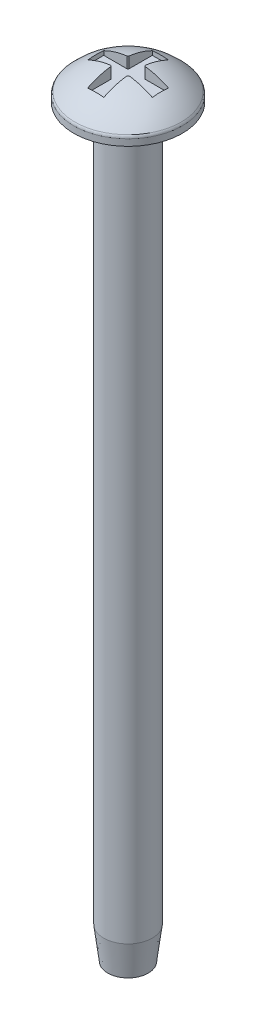
ISO-10303-21;
HEADER;
FILE_DESCRIPTION(('STEP AP214'),'2;1');
FILE_NAME('part.step','',(''),(''),'','','');
FILE_SCHEMA(('AUTOMOTIVE_DESIGN { 1 0 10303 214 1 1 1 1 }'));
ENDSEC;
DATA;
#1=APPLICATION_CONTEXT('core data for automotive mechanical design processes');
#2=APPLICATION_PROTOCOL_DEFINITION('international standard','automotive_design',2000,#1);
#3=PRODUCT_CONTEXT('',#1,'mechanical');
#4=PRODUCT('Part','Part','',(#3));
#5=PRODUCT_RELATED_PRODUCT_CATEGORY('part','',(#4));
#6=PRODUCT_DEFINITION_FORMATION('','',#4);
#7=PRODUCT_DEFINITION_CONTEXT('part definition',#1,'design');
#8=PRODUCT_DEFINITION('design','',#6,#7);
#9=PRODUCT_DEFINITION_SHAPE('','',#8);
#10=(LENGTH_UNIT() NAMED_UNIT(*) SI_UNIT(.MILLI.,.METRE.));
#11=(NAMED_UNIT(*) PLANE_ANGLE_UNIT() SI_UNIT($,.RADIAN.));
#12=(NAMED_UNIT(*) SI_UNIT($,.STERADIAN.) SOLID_ANGLE_UNIT());
#13=UNCERTAINTY_MEASURE_WITH_UNIT(LENGTH_MEASURE(1.E-05),#10,'distance_accuracy_value','');
#14=(GEOMETRIC_REPRESENTATION_CONTEXT(3) GLOBAL_UNCERTAINTY_ASSIGNED_CONTEXT((#13)) GLOBAL_UNIT_ASSIGNED_CONTEXT((#10,
#11,#12)) REPRESENTATION_CONTEXT('',''));
#15=CARTESIAN_POINT('',(0.,0.,0.));
#16=DIRECTION('',(0.,0.,1.));
#17=DIRECTION('',(1.,0.,0.));
#18=AXIS2_PLACEMENT_3D('',#15,#16,#17);
#19=CARTESIAN_POINT('',(0.,0.,0.));
#20=DIRECTION('',(0.,-1.,0.));
#21=DIRECTION('',(1.,0.,0.));
#22=AXIS2_PLACEMENT_3D('',#19,#20,#21);
#23=SPHERICAL_SURFACE('',#22,4.5);
#24=CARTESIAN_POINT('',(0.,3.07369941468059,0.));
#25=DIRECTION('',(0.,-1.,0.));
#26=DIRECTION('',(0.,0.,-1.));
#27=AXIS2_PLACEMENT_3D('',#24,#25,#26);
#28=CIRCLE('',#27,3.28669619955849);
#29=CARTESIAN_POINT('',(0.,3.07369941468059,-3.28669619955849));
#30=VERTEX_POINT('',#29);
#31=EDGE_CURVE('E173',#30,#30,#28,.F.);
#32=ORIENTED_EDGE('',*,*,#31,.T.);
#33=EDGE_LOOP('',(#32));
#34=FACE_BOUND('',#33,.T.);
#35=CARTESIAN_POINT('',(-0.5,0.,0.));
#36=DIRECTION('',(1.,0.,0.));
#37=DIRECTION('',(0.,0.,-1.));
#38=AXIS2_PLACEMENT_3D('',#35,#36,#37);
#39=CIRCLE('',#38,4.47213595499958);
#40=CARTESIAN_POINT('',(-0.5,4.43705983732471,-0.559016994374947));
#41=VERTEX_POINT('',#40);
#42=CARTESIAN_POINT('',(-0.5,4.,-2.));
#43=VERTEX_POINT('',#42);
#44=EDGE_CURVE('E182',#41,#43,#39,.F.);
#45=ORIENTED_EDGE('',*,*,#44,.T.);
#46=CARTESIAN_POINT('',(0.,0.,-2.));
#47=DIRECTION('',(0.,0.,1.));
#48=DIRECTION('',(1.,0.,0.));
#49=AXIS2_PLACEMENT_3D('',#46,#47,#48);
#50=CIRCLE('',#49,4.03112887414927);
#51=CARTESIAN_POINT('',(0.5,4.,-2.));
#52=VERTEX_POINT('',#51);
#53=EDGE_CURVE('E11',#43,#52,#50,.F.);
#54=ORIENTED_EDGE('',*,*,#53,.T.);
#55=CARTESIAN_POINT('',(0.5,0.,0.));
#56=DIRECTION('',(-1.,0.,0.));
#57=DIRECTION('',(0.,0.,1.));
#58=AXIS2_PLACEMENT_3D('',#55,#56,#57);
#59=CIRCLE('',#58,4.47213595499958);
#60=CARTESIAN_POINT('',(0.5,4.43705983732471,-0.559016994374947));
#61=VERTEX_POINT('',#60);
#62=EDGE_CURVE('E38',#52,#61,#59,.F.);
#63=ORIENTED_EDGE('',*,*,#62,.T.);
#64=CARTESIAN_POINT('',(0.,4.43705983732471,0.));
#65=DIRECTION('',(0.,-1.,0.));
#66=DIRECTION('',(0.,0.,-1.));
#67=AXIS2_PLACEMENT_3D('',#64,#65,#66);
#68=CIRCLE('',#67,0.75);
#69=CARTESIAN_POINT('',(0.559016994374942,4.43705983732471,-0.500000000000006));
#70=VERTEX_POINT('',#69);
#71=EDGE_CURVE('E221',#61,#70,#68,.T.);
#72=ORIENTED_EDGE('',*,*,#71,.T.);
#73=CARTESIAN_POINT('',(0.,0.,-0.5));
#74=DIRECTION('',(0.,0.,1.));
#75=DIRECTION('',(1.,0.,0.));
#76=AXIS2_PLACEMENT_3D('',#73,#74,#75);
#77=CIRCLE('',#76,4.47213595499958);
#78=CARTESIAN_POINT('',(1.99999999999999,4.,-0.500000000000021));
#79=VERTEX_POINT('',#78);
#80=EDGE_CURVE('E218',#70,#79,#77,.F.);
#81=ORIENTED_EDGE('',*,*,#80,.T.);
#82=CARTESIAN_POINT('',(2.,0.,0.));
#83=DIRECTION('',(-1.,0.,0.));
#84=DIRECTION('',(0.,0.,1.));
#85=AXIS2_PLACEMENT_3D('',#82,#83,#84);
#86=CIRCLE('',#85,4.03112887414927);
#87=CARTESIAN_POINT('',(2.00000000000001,4.,0.499999999999979));
#88=VERTEX_POINT('',#87);
#89=EDGE_CURVE('E215',#79,#88,#86,.F.);
#90=ORIENTED_EDGE('',*,*,#89,.T.);
#91=CARTESIAN_POINT('',(0.,0.,0.5));
#92=DIRECTION('',(0.,0.,-1.));
#93=DIRECTION('',(-1.,0.,0.));
#94=AXIS2_PLACEMENT_3D('',#91,#92,#93);
#95=CIRCLE('',#94,4.47213595499958);
#96=CARTESIAN_POINT('',(0.559016994374952,4.43705983732471,0.499999999999994));
#97=VERTEX_POINT('',#96);
#98=EDGE_CURVE('E212',#88,#97,#95,.F.);
#99=ORIENTED_EDGE('',*,*,#98,.T.);
#100=CARTESIAN_POINT('',(0.,4.43705983732471,0.));
#101=DIRECTION('',(0.,-1.,0.));
#102=DIRECTION('',(0.,0.,-1.));
#103=AXIS2_PLACEMENT_3D('',#100,#101,#102);
#104=CIRCLE('',#103,0.75);
#105=CARTESIAN_POINT('',(0.500000000000004,4.43705983732471,0.559016994374944));
#106=VERTEX_POINT('',#105);
#107=EDGE_CURVE('E209',#97,#106,#104,.T.);
#108=ORIENTED_EDGE('',*,*,#107,.T.);
#109=CARTESIAN_POINT('',(0.5,0.,0.));
#110=DIRECTION('',(-1.,0.,0.));
#111=DIRECTION('',(0.,0.,1.));
#112=AXIS2_PLACEMENT_3D('',#109,#110,#111);
#113=CIRCLE('',#112,4.47213595499958);
#114=CARTESIAN_POINT('',(0.500000000000014,4.,2.));
#115=VERTEX_POINT('',#114);
#116=EDGE_CURVE('E206',#106,#115,#113,.F.);
#117=ORIENTED_EDGE('',*,*,#116,.T.);
#118=CARTESIAN_POINT('',(0.,0.,2.));
#119=DIRECTION('',(0.,0.,-1.));
#120=DIRECTION('',(-1.,0.,0.));
#121=AXIS2_PLACEMENT_3D('',#118,#119,#120);
#122=CIRCLE('',#121,4.03112887414927);
#123=CARTESIAN_POINT('',(-0.499999999999986,4.,2.));
#124=VERTEX_POINT('',#123);
#125=EDGE_CURVE('E203',#115,#124,#122,.F.);
#126=ORIENTED_EDGE('',*,*,#125,.T.);
#127=CARTESIAN_POINT('',(-0.5,0.,0.));
#128=DIRECTION('',(1.,0.,0.));
#129=DIRECTION('',(0.,0.,-1.));
#130=AXIS2_PLACEMENT_3D('',#127,#128,#129);
#131=CIRCLE('',#130,4.47213595499958);
#132=CARTESIAN_POINT('',(-0.499999999999996,4.43705983732471,0.559016994374951));
#133=VERTEX_POINT('',#132);
#134=EDGE_CURVE('E200',#124,#133,#131,.F.);
#135=ORIENTED_EDGE('',*,*,#134,.T.);
#136=CARTESIAN_POINT('',(0.,4.43705983732471,0.));
#137=DIRECTION('',(0.,-1.,0.));
#138=DIRECTION('',(0.,0.,-1.));
#139=AXIS2_PLACEMENT_3D('',#136,#137,#138);
#140=CIRCLE('',#139,0.75);
#141=CARTESIAN_POINT('',(-0.559016994374946,4.43705983732471,0.500000000000002));
#142=VERTEX_POINT('',#141);
#143=EDGE_CURVE('E197',#133,#142,#140,.T.);
#144=ORIENTED_EDGE('',*,*,#143,.T.);
#145=CARTESIAN_POINT('',(0.,0.,0.5));
#146=DIRECTION('',(0.,0.,-1.));
#147=DIRECTION('',(-1.,0.,0.));
#148=AXIS2_PLACEMENT_3D('',#145,#146,#147);
#149=CIRCLE('',#148,4.47213595499958);
#150=CARTESIAN_POINT('',(-2.,4.,0.500000000000007));
#151=VERTEX_POINT('',#150);
#152=EDGE_CURVE('E194',#142,#151,#149,.F.);
#153=ORIENTED_EDGE('',*,*,#152,.T.);
#154=CARTESIAN_POINT('',(-2.,0.,0.));
#155=DIRECTION('',(1.,0.,0.));
#156=DIRECTION('',(0.,0.,-1.));
#157=AXIS2_PLACEMENT_3D('',#154,#155,#156);
#158=CIRCLE('',#157,4.03112887414927);
#159=CARTESIAN_POINT('',(-2.,4.,-0.499999999999993));
#160=VERTEX_POINT('',#159);
#161=EDGE_CURVE('E191',#151,#160,#158,.F.);
#162=ORIENTED_EDGE('',*,*,#161,.T.);
#163=CARTESIAN_POINT('',(0.,0.,-0.5));
#164=DIRECTION('',(0.,0.,1.));
#165=DIRECTION('',(1.,0.,0.));
#166=AXIS2_PLACEMENT_3D('',#163,#164,#165);
#167=CIRCLE('',#166,4.47213595499958);
#168=CARTESIAN_POINT('',(-0.559016994374949,4.43705983732471,-0.499999999999998));
#169=VERTEX_POINT('',#168);
#170=EDGE_CURVE('E188',#160,#169,#167,.F.);
#171=ORIENTED_EDGE('',*,*,#170,.T.);
#172=CARTESIAN_POINT('',(0.,4.43705983732471,0.));
#173=DIRECTION('',(0.,-1.,0.));
#174=DIRECTION('',(0.,0.,-1.));
#175=AXIS2_PLACEMENT_3D('',#172,#173,#174);
#176=CIRCLE('',#175,0.75);
#177=EDGE_CURVE('E185',#169,#41,#176,.T.);
#178=ORIENTED_EDGE('',*,*,#177,.T.);
#179=EDGE_LOOP('',(#45,#54,#63,#72,#81,#90,#99,#108,#117,#126,#135,#144,#153,#162,#171,#178));
#180=FACE_BOUND('',#179,.T.);
#181=ADVANCED_FACE('F31',(#34,#180),#23,.T.);
#182=CARTESIAN_POINT('',(0.,2.5,0.));
#183=DIRECTION('',(0.,-1.,0.));
#184=DIRECTION('',(0.,0.,-1.));
#185=AXIS2_PLACEMENT_3D('',#182,#183,#184);
#186=PLANE('',#185);
#187=CARTESIAN_POINT('',(0.,2.5,0.));
#188=DIRECTION('',(0.,-1.,0.));
#189=DIRECTION('',(0.,0.,-1.));
#190=AXIS2_PLACEMENT_3D('',#187,#188,#189);
#191=CIRCLE('',#190,3.35410196624968);
#192=CARTESIAN_POINT('',(0.,2.5,-3.35410196624968));
#193=VERTEX_POINT('',#192);
#194=EDGE_CURVE('E162',#193,#193,#191,.T.);
#195=ORIENTED_EDGE('',*,*,#194,.T.);
#196=EDGE_LOOP('',(#195));
#197=FACE_BOUND('',#196,.T.);
#198=CARTESIAN_POINT('',(0.,2.5,0.));
#199=DIRECTION('',(0.,-1.,0.));
#200=DIRECTION('',(0.,0.,-1.));
#201=AXIS2_PLACEMENT_3D('',#198,#199,#200);
#202=CIRCLE('',#201,1.5);
#203=CARTESIAN_POINT('',(0.,2.5,-1.5));
#204=VERTEX_POINT('',#203);
#205=EDGE_CURVE('E158',#204,#204,#202,.T.);
#206=ORIENTED_EDGE('',*,*,#205,.F.);
#207=EDGE_LOOP('',(#206));
#208=FACE_BOUND('',#207,.T.);
#209=ADVANCED_FACE('F349',(#197,#208),#186,.T.);
#210=CARTESIAN_POINT('',(0.,2.5,0.));
#211=DIRECTION('',(0.,1.,0.));
#212=DIRECTION('',(0.,0.,1.));
#213=AXIS2_PLACEMENT_3D('',#210,#211,#212);
#214=CYLINDRICAL_SURFACE('',#213,3.35410196624968);
#215=CARTESIAN_POINT('',(0.,2.90293833608722,0.));
#216=DIRECTION('',(0.,-1.,0.));
#217=DIRECTION('',(0.,0.,-1.));
#218=AXIS2_PLACEMENT_3D('',#215,#216,#217);
#219=CIRCLE('',#218,3.35410196624968);
#220=CARTESIAN_POINT('',(0.,2.90293833608722,-3.35410196624968));
#221=VERTEX_POINT('',#220);
#222=EDGE_CURVE('E170',#221,#221,#219,.T.);
#223=ORIENTED_EDGE('',*,*,#222,.T.);
#224=EDGE_LOOP('',(#223));
#225=FACE_BOUND('',#224,.T.);
#226=ORIENTED_EDGE('',*,*,#194,.F.);
#227=EDGE_LOOP('',(#226));
#228=FACE_BOUND('',#227,.T.);
#229=ADVANCED_FACE('F354',(#225,#228),#214,.T.);
#230=CARTESIAN_POINT('',(0.,2.90293833608722,0.));
#231=DIRECTION('',(0.,-1.,0.));
#232=DIRECTION('',(0.,0.,-1.));
#233=AXIS2_PLACEMENT_3D('',#230,#231,#232);
#234=TOROIDAL_SURFACE('',#233,3.10410196624968,0.25);
#235=ORIENTED_EDGE('',*,*,#31,.F.);
#236=EDGE_LOOP('',(#235));
#237=FACE_BOUND('',#236,.T.);
#238=ORIENTED_EDGE('',*,*,#222,.F.);
#239=EDGE_LOOP('',(#238));
#240=FACE_BOUND('',#239,.T.);
#241=ADVANCED_FACE('F359',(#237,#240),#234,.T.);
#242=CARTESIAN_POINT('',(0.,-43.5,0.));
#243=DIRECTION('',(0.,1.,0.));
#244=DIRECTION('',(0.,0.,1.));
#245=AXIS2_PLACEMENT_3D('',#242,#243,#244);
#246=CYLINDRICAL_SURFACE('',#245,1.5);
#247=CARTESIAN_POINT('',(0.,-41.5,0.));
#248=DIRECTION('',(0.,-1.,0.));
#249=DIRECTION('',(0.,0.,-1.));
#250=AXIS2_PLACEMENT_3D('',#247,#248,#249);
#251=CIRCLE('',#250,1.5);
#252=CARTESIAN_POINT('',(0.,-41.5,-1.5));
#253=VERTEX_POINT('',#252);
#254=EDGE_CURVE('E179',#253,#253,#251,.F.);
#255=ORIENTED_EDGE('',*,*,#254,.T.);
#256=EDGE_LOOP('',(#255));
#257=FACE_BOUND('',#256,.T.);
#258=ORIENTED_EDGE('',*,*,#205,.T.);
#259=EDGE_LOOP('',(#258));
#260=FACE_BOUND('',#259,.T.);
#261=ADVANCED_FACE('F362',(#257,#260),#246,.T.);
#262=CARTESIAN_POINT('',(0.,-43.5,0.));
#263=DIRECTION('',(0.,-1.,0.));
#264=DIRECTION('',(0.,0.,-1.));
#265=AXIS2_PLACEMENT_3D('',#262,#263,#264);
#266=PLANE('',#265);
#267=CARTESIAN_POINT('',(0.,-43.5,0.));
#268=DIRECTION('',(0.,-1.,0.));
#269=DIRECTION('',(0.,0.,-1.));
#270=AXIS2_PLACEMENT_3D('',#267,#268,#269);
#271=CIRCLE('',#270,1.25);
#272=CARTESIAN_POINT('',(0.,-43.5,-1.25));
#273=VERTEX_POINT('',#272);
#274=EDGE_CURVE('E176',#273,#273,#271,.T.);
#275=ORIENTED_EDGE('',*,*,#274,.T.);
#276=EDGE_LOOP('',(#275));
#277=FACE_BOUND('',#276,.T.);
#278=ADVANCED_FACE('F373',(#277),#266,.T.);
#279=CARTESIAN_POINT('',(0.,-43.5,0.));
#280=DIRECTION('',(0.,1.,0.));
#281=DIRECTION('',(0.,0.,1.));
#282=AXIS2_PLACEMENT_3D('',#279,#280,#281);
#283=CONICAL_SURFACE('',#282,1.25,0.124354994546761);
#284=ORIENTED_EDGE('',*,*,#254,.F.);
#285=EDGE_LOOP('',(#284));
#286=FACE_BOUND('',#285,.T.);
#287=ORIENTED_EDGE('',*,*,#274,.F.);
#288=EDGE_LOOP('',(#287));
#289=FACE_BOUND('',#288,.T.);
#290=ADVANCED_FACE('F379',(#286,#289),#283,.T.);
#291=CARTESIAN_POINT('',(-0.5,3.75,-2.));
#292=DIRECTION('',(0.,0.,1.));
#293=DIRECTION('',(1.,0.,0.));
#294=AXIS2_PLACEMENT_3D('',#291,#292,#293);
#295=PLANE('',#294);
#296=DIRECTION('',(0.,1.,0.));
#297=VECTOR('',#296,1.);
#298=CARTESIAN_POINT('',(-0.5,3.75,-2.));
#299=LINE('',#298,#297);
#300=CARTESIAN_POINT('',(-0.5,3.75,-2.));
#301=VERTEX_POINT('',#300);
#302=EDGE_CURVE('E45',#301,#43,#299,.T.);
#303=ORIENTED_EDGE('',*,*,#302,.F.);
#304=DIRECTION('',(1.,0.,0.));
#305=VECTOR('',#304,1.);
#306=CARTESIAN_POINT('',(-0.5,3.75,-2.));
#307=LINE('',#306,#305);
#308=CARTESIAN_POINT('',(0.5,3.75,-2.));
#309=VERTEX_POINT('',#308);
#310=EDGE_CURVE('E148',#301,#309,#307,.T.);
#311=ORIENTED_EDGE('',*,*,#310,.T.);
#312=DIRECTION('',(0.,1.,0.));
#313=VECTOR('',#312,1.);
#314=CARTESIAN_POINT('',(0.5,3.75,-2.));
#315=LINE('',#314,#313);
#316=EDGE_CURVE('E155',#309,#52,#315,.T.);
#317=ORIENTED_EDGE('',*,*,#316,.T.);
#318=ORIENTED_EDGE('',*,*,#53,.F.);
#319=EDGE_LOOP('',(#303,#311,#317,#318));
#320=FACE_BOUND('',#319,.T.);
#321=ADVANCED_FACE('F154',(#320),#295,.T.);
#322=CARTESIAN_POINT('',(0.5,3.75,-2.));
#323=DIRECTION('',(-1.,0.,0.));
#324=DIRECTION('',(0.,0.,1.));
#325=AXIS2_PLACEMENT_3D('',#322,#323,#324);
#326=PLANE('',#325);
#327=ORIENTED_EDGE('',*,*,#316,.F.);
#328=DIRECTION('',(0.,0.,1.));
#329=VECTOR('',#328,1.);
#330=CARTESIAN_POINT('',(0.5,3.75,-2.));
#331=LINE('',#330,#329);
#332=CARTESIAN_POINT('',(0.5,3.75,-0.559016994374947));
#333=VERTEX_POINT('',#332);
#334=EDGE_CURVE('E144',#309,#333,#331,.T.);
#335=ORIENTED_EDGE('',*,*,#334,.T.);
#336=DIRECTION('',(0.,1.,0.));
#337=VECTOR('',#336,1.);
#338=CARTESIAN_POINT('',(0.5,3.75,-0.559016994374947));
#339=LINE('',#338,#337);
#340=EDGE_CURVE('E159',#333,#61,#339,.T.);
#341=ORIENTED_EDGE('',*,*,#340,.T.);
#342=ORIENTED_EDGE('',*,*,#62,.F.);
#343=EDGE_LOOP('',(#327,#335,#341,#342));
#344=FACE_BOUND('',#343,.T.);
#345=ADVANCED_FACE('F157',(#344),#326,.T.);
#346=CARTESIAN_POINT('',(0.,3.75,0.));
#347=DIRECTION('',(0.,1.,0.));
#348=DIRECTION('',(0.,0.,1.));
#349=AXIS2_PLACEMENT_3D('',#346,#347,#348);
#350=CYLINDRICAL_SURFACE('',#349,0.75);
#351=ORIENTED_EDGE('',*,*,#340,.F.);
#352=CARTESIAN_POINT('',(0.,3.75,0.));
#353=DIRECTION('',(0.,-1.,0.));
#354=DIRECTION('',(0.,0.,-1.));
#355=AXIS2_PLACEMENT_3D('',#352,#353,#354);
#356=CIRCLE('',#355,0.75);
#357=CARTESIAN_POINT('',(0.559016994374942,3.75,-0.500000000000006));
#358=VERTEX_POINT('',#357);
#359=EDGE_CURVE('E150',#333,#358,#356,.T.);
#360=ORIENTED_EDGE('',*,*,#359,.T.);
#361=DIRECTION('',(0.,1.,0.));
#362=VECTOR('',#361,1.);
#363=CARTESIAN_POINT('',(0.559016994374942,3.75,-0.500000000000006));
#364=LINE('',#363,#362);
#365=EDGE_CURVE('E164',#358,#70,#364,.T.);
#366=ORIENTED_EDGE('',*,*,#365,.T.);
#367=ORIENTED_EDGE('',*,*,#71,.F.);
#368=EDGE_LOOP('',(#351,#360,#366,#367));
#369=FACE_BOUND('',#368,.T.);
#370=ADVANCED_FACE('F273',(#369),#350,.F.);
#371=CARTESIAN_POINT('',(1.99999999999999,3.75,-0.500000000000021));
#372=DIRECTION('',(0.,0.,1.));
#373=DIRECTION('',(1.,0.,0.));
#374=AXIS2_PLACEMENT_3D('',#371,#372,#373);
#375=PLANE('',#374);
#376=ORIENTED_EDGE('',*,*,#365,.F.);
#377=DIRECTION('',(1.,0.,0.));
#378=VECTOR('',#377,1.);
#379=CARTESIAN_POINT('',(1.99999999999999,3.75,-0.500000000000021));
#380=LINE('',#379,#378);
#381=CARTESIAN_POINT('',(1.99999999999999,3.75,-0.500000000000021));
#382=VERTEX_POINT('',#381);
#383=EDGE_CURVE('E276',#358,#382,#380,.T.);
#384=ORIENTED_EDGE('',*,*,#383,.T.);
#385=DIRECTION('',(0.,1.,0.));
#386=VECTOR('',#385,1.);
#387=CARTESIAN_POINT('',(1.99999999999999,3.75,-0.500000000000021));
#388=LINE('',#387,#386);
#389=EDGE_CURVE('E268',#382,#79,#388,.T.);
#390=ORIENTED_EDGE('',*,*,#389,.T.);
#391=ORIENTED_EDGE('',*,*,#80,.F.);
#392=EDGE_LOOP('',(#376,#384,#390,#391));
#393=FACE_BOUND('',#392,.T.);
#394=ADVANCED_FACE('F275',(#393),#375,.T.);
#395=CARTESIAN_POINT('',(1.99999999999999,3.75,-0.500000000000021));
#396=DIRECTION('',(-1.,0.,0.));
#397=DIRECTION('',(0.,0.,1.));
#398=AXIS2_PLACEMENT_3D('',#395,#396,#397);
#399=PLANE('',#398);
#400=ORIENTED_EDGE('',*,*,#389,.F.);
#401=DIRECTION('',(0.,0.,1.));
#402=VECTOR('',#401,1.);
#403=CARTESIAN_POINT('',(1.99999999999999,3.75,-0.500000000000021));
#404=LINE('',#403,#402);
#405=CARTESIAN_POINT('',(2.00000000000001,3.75,0.499999999999979));
#406=VERTEX_POINT('',#405);
#407=EDGE_CURVE('E280',#382,#406,#404,.T.);
#408=ORIENTED_EDGE('',*,*,#407,.T.);
#409=DIRECTION('',(0.,1.,0.));
#410=VECTOR('',#409,1.);
#411=CARTESIAN_POINT('',(2.00000000000001,3.75,0.499999999999979));
#412=LINE('',#411,#410);
#413=EDGE_CURVE('E265',#406,#88,#412,.T.);
#414=ORIENTED_EDGE('',*,*,#413,.T.);
#415=ORIENTED_EDGE('',*,*,#89,.F.);
#416=EDGE_LOOP('',(#400,#408,#414,#415));
#417=FACE_BOUND('',#416,.T.);
#418=ADVANCED_FACE('F339',(#417),#399,.T.);
#419=CARTESIAN_POINT('',(2.00000000000001,3.75,0.499999999999979));
#420=DIRECTION('',(0.,0.,-1.));
#421=DIRECTION('',(-1.,0.,0.));
#422=AXIS2_PLACEMENT_3D('',#419,#420,#421);
#423=PLANE('',#422);
#424=ORIENTED_EDGE('',*,*,#413,.F.);
#425=DIRECTION('',(-1.,0.,0.));
#426=VECTOR('',#425,1.);
#427=CARTESIAN_POINT('',(2.00000000000001,3.75,0.499999999999979));
#428=LINE('',#427,#426);
#429=CARTESIAN_POINT('',(0.559016994374952,3.75,0.499999999999994));
#430=VERTEX_POINT('',#429);
#431=EDGE_CURVE('E282',#406,#430,#428,.T.);
#432=ORIENTED_EDGE('',*,*,#431,.T.);
#433=DIRECTION('',(0.,1.,0.));
#434=VECTOR('',#433,1.);
#435=CARTESIAN_POINT('',(0.559016994374952,3.75,0.499999999999994));
#436=LINE('',#435,#434);
#437=EDGE_CURVE('E262',#430,#97,#436,.T.);
#438=ORIENTED_EDGE('',*,*,#437,.T.);
#439=ORIENTED_EDGE('',*,*,#98,.F.);
#440=EDGE_LOOP('',(#424,#432,#438,#439));
#441=FACE_BOUND('',#440,.T.);
#442=ADVANCED_FACE('F337',(#441),#423,.T.);
#443=CARTESIAN_POINT('',(0.,3.75,0.));
#444=DIRECTION('',(0.,1.,0.));
#445=DIRECTION('',(0.,0.,1.));
#446=AXIS2_PLACEMENT_3D('',#443,#444,#445);
#447=CYLINDRICAL_SURFACE('',#446,0.75);
#448=ORIENTED_EDGE('',*,*,#437,.F.);
#449=CARTESIAN_POINT('',(0.,3.75,0.));
#450=DIRECTION('',(0.,-1.,0.));
#451=DIRECTION('',(0.,0.,-1.));
#452=AXIS2_PLACEMENT_3D('',#449,#450,#451);
#453=CIRCLE('',#452,0.75);
#454=CARTESIAN_POINT('',(0.500000000000004,3.75,0.559016994374944));
#455=VERTEX_POINT('',#454);
#456=EDGE_CURVE('E287',#430,#455,#453,.T.);
#457=ORIENTED_EDGE('',*,*,#456,.T.);
#458=DIRECTION('',(0.,1.,0.));
#459=VECTOR('',#458,1.);
#460=CARTESIAN_POINT('',(0.500000000000004,3.75,0.559016994374944));
#461=LINE('',#460,#459);
#462=EDGE_CURVE('E259',#455,#106,#461,.T.);
#463=ORIENTED_EDGE('',*,*,#462,.T.);
#464=ORIENTED_EDGE('',*,*,#107,.F.);
#465=EDGE_LOOP('',(#448,#457,#463,#464));
#466=FACE_BOUND('',#465,.T.);
#467=ADVANCED_FACE('F333',(#466),#447,.F.);
#468=CARTESIAN_POINT('',(0.500000000000014,3.75,2.));
#469=DIRECTION('',(-1.,0.,0.));
#470=DIRECTION('',(0.,0.,1.));
#471=AXIS2_PLACEMENT_3D('',#468,#469,#470);
#472=PLANE('',#471);
#473=ORIENTED_EDGE('',*,*,#462,.F.);
#474=DIRECTION('',(0.,0.,1.));
#475=VECTOR('',#474,1.);
#476=CARTESIAN_POINT('',(0.500000000000014,3.75,2.));
#477=LINE('',#476,#475);
#478=CARTESIAN_POINT('',(0.500000000000014,3.75,2.));
#479=VERTEX_POINT('',#478);
#480=EDGE_CURVE('E289',#455,#479,#477,.T.);
#481=ORIENTED_EDGE('',*,*,#480,.T.);
#482=DIRECTION('',(0.,1.,0.));
#483=VECTOR('',#482,1.);
#484=CARTESIAN_POINT('',(0.500000000000014,3.75,2.));
#485=LINE('',#484,#483);
#486=EDGE_CURVE('E256',#479,#115,#485,.T.);
#487=ORIENTED_EDGE('',*,*,#486,.T.);
#488=ORIENTED_EDGE('',*,*,#116,.F.);
#489=EDGE_LOOP('',(#473,#481,#487,#488));
#490=FACE_BOUND('',#489,.T.);
#491=ADVANCED_FACE('F330',(#490),#472,.T.);
#492=CARTESIAN_POINT('',(0.500000000000014,3.75,2.));
#493=DIRECTION('',(0.,0.,-1.));
#494=DIRECTION('',(-1.,0.,0.));
#495=AXIS2_PLACEMENT_3D('',#492,#493,#494);
#496=PLANE('',#495);
#497=ORIENTED_EDGE('',*,*,#486,.F.);
#498=DIRECTION('',(-1.,0.,0.));
#499=VECTOR('',#498,1.);
#500=CARTESIAN_POINT('',(0.500000000000014,3.75,2.));
#501=LINE('',#500,#499);
#502=CARTESIAN_POINT('',(-0.499999999999986,3.75,2.));
#503=VERTEX_POINT('',#502);
#504=EDGE_CURVE('E291',#479,#503,#501,.T.);
#505=ORIENTED_EDGE('',*,*,#504,.T.);
#506=DIRECTION('',(0.,1.,0.));
#507=VECTOR('',#506,1.);
#508=CARTESIAN_POINT('',(-0.499999999999986,3.75,2.));
#509=LINE('',#508,#507);
#510=EDGE_CURVE('E253',#503,#124,#509,.T.);
#511=ORIENTED_EDGE('',*,*,#510,.T.);
#512=ORIENTED_EDGE('',*,*,#125,.F.);
#513=EDGE_LOOP('',(#497,#505,#511,#512));
#514=FACE_BOUND('',#513,.T.);
#515=ADVANCED_FACE('F327',(#514),#496,.T.);
#516=CARTESIAN_POINT('',(-0.499999999999986,3.75,2.));
#517=DIRECTION('',(1.,0.,0.));
#518=DIRECTION('',(0.,0.,-1.));
#519=AXIS2_PLACEMENT_3D('',#516,#517,#518);
#520=PLANE('',#519);
#521=ORIENTED_EDGE('',*,*,#510,.F.);
#522=DIRECTION('',(0.,0.,-1.));
#523=VECTOR('',#522,1.);
#524=CARTESIAN_POINT('',(-0.499999999999986,3.75,2.));
#525=LINE('',#524,#523);
#526=CARTESIAN_POINT('',(-0.499999999999996,3.75,0.559016994374951));
#527=VERTEX_POINT('',#526);
#528=EDGE_CURVE('E293',#503,#527,#525,.T.);
#529=ORIENTED_EDGE('',*,*,#528,.T.);
#530=DIRECTION('',(0.,1.,0.));
#531=VECTOR('',#530,1.);
#532=CARTESIAN_POINT('',(-0.499999999999996,3.75,0.559016994374951));
#533=LINE('',#532,#531);
#534=EDGE_CURVE('E250',#527,#133,#533,.T.);
#535=ORIENTED_EDGE('',*,*,#534,.T.);
#536=ORIENTED_EDGE('',*,*,#134,.F.);
#537=EDGE_LOOP('',(#521,#529,#535,#536));
#538=FACE_BOUND('',#537,.T.);
#539=ADVANCED_FACE('F324',(#538),#520,.T.);
#540=CARTESIAN_POINT('',(0.,3.75,0.));
#541=DIRECTION('',(0.,1.,0.));
#542=DIRECTION('',(0.,0.,1.));
#543=AXIS2_PLACEMENT_3D('',#540,#541,#542);
#544=CYLINDRICAL_SURFACE('',#543,0.75);
#545=ORIENTED_EDGE('',*,*,#534,.F.);
#546=CARTESIAN_POINT('',(0.,3.75,0.));
#547=DIRECTION('',(0.,-1.,0.));
#548=DIRECTION('',(0.,0.,-1.));
#549=AXIS2_PLACEMENT_3D('',#546,#547,#548);
#550=CIRCLE('',#549,0.75);
#551=CARTESIAN_POINT('',(-0.559016994374946,3.75,0.500000000000002));
#552=VERTEX_POINT('',#551);
#553=EDGE_CURVE('E295',#527,#552,#550,.T.);
#554=ORIENTED_EDGE('',*,*,#553,.T.);
#555=DIRECTION('',(0.,1.,0.));
#556=VECTOR('',#555,1.);
#557=CARTESIAN_POINT('',(-0.559016994374946,3.75,0.500000000000002));
#558=LINE('',#557,#556);
#559=EDGE_CURVE('E247',#552,#142,#558,.T.);
#560=ORIENTED_EDGE('',*,*,#559,.T.);
#561=ORIENTED_EDGE('',*,*,#143,.F.);
#562=EDGE_LOOP('',(#545,#554,#560,#561));
#563=FACE_BOUND('',#562,.T.);
#564=ADVANCED_FACE('F317',(#563),#544,.F.);
#565=CARTESIAN_POINT('',(-2.,3.75,0.500000000000007));
#566=DIRECTION('',(0.,0.,-1.));
#567=DIRECTION('',(-1.,0.,0.));
#568=AXIS2_PLACEMENT_3D('',#565,#566,#567);
#569=PLANE('',#568);
#570=ORIENTED_EDGE('',*,*,#559,.F.);
#571=DIRECTION('',(-1.,0.,0.));
#572=VECTOR('',#571,1.);
#573=CARTESIAN_POINT('',(-2.,3.75,0.500000000000007));
#574=LINE('',#573,#572);
#575=CARTESIAN_POINT('',(-2.,3.75,0.500000000000007));
#576=VERTEX_POINT('',#575);
#577=EDGE_CURVE('E297',#552,#576,#574,.T.);
#578=ORIENTED_EDGE('',*,*,#577,.T.);
#579=DIRECTION('',(0.,1.,0.));
#580=VECTOR('',#579,1.);
#581=CARTESIAN_POINT('',(-2.,3.75,0.500000000000007));
#582=LINE('',#581,#580);
#583=EDGE_CURVE('E244',#576,#151,#582,.T.);
#584=ORIENTED_EDGE('',*,*,#583,.T.);
#585=ORIENTED_EDGE('',*,*,#152,.F.);
#586=EDGE_LOOP('',(#570,#578,#584,#585));
#587=FACE_BOUND('',#586,.T.);
#588=ADVANCED_FACE('F314',(#587),#569,.T.);
#589=CARTESIAN_POINT('',(-2.,3.75,0.500000000000007));
#590=DIRECTION('',(1.,0.,0.));
#591=DIRECTION('',(0.,0.,-1.));
#592=AXIS2_PLACEMENT_3D('',#589,#590,#591);
#593=PLANE('',#592);
#594=ORIENTED_EDGE('',*,*,#583,.F.);
#595=DIRECTION('',(0.,0.,-1.));
#596=VECTOR('',#595,1.);
#597=CARTESIAN_POINT('',(-2.,3.75,0.500000000000007));
#598=LINE('',#597,#596);
#599=CARTESIAN_POINT('',(-2.,3.75,-0.499999999999993));
#600=VERTEX_POINT('',#599);
#601=EDGE_CURVE('E299',#576,#600,#598,.T.);
#602=ORIENTED_EDGE('',*,*,#601,.T.);
#603=DIRECTION('',(0.,1.,0.));
#604=VECTOR('',#603,1.);
#605=CARTESIAN_POINT('',(-2.,3.75,-0.499999999999993));
#606=LINE('',#605,#604);
#607=EDGE_CURVE('E236',#600,#160,#606,.T.);
#608=ORIENTED_EDGE('',*,*,#607,.T.);
#609=ORIENTED_EDGE('',*,*,#161,.F.);
#610=EDGE_LOOP('',(#594,#602,#608,#609));
#611=FACE_BOUND('',#610,.T.);
#612=ADVANCED_FACE('F311',(#611),#593,.T.);
#613=CARTESIAN_POINT('',(-2.,3.75,-0.499999999999993));
#614=DIRECTION('',(0.,0.,1.));
#615=DIRECTION('',(1.,0.,0.));
#616=AXIS2_PLACEMENT_3D('',#613,#614,#615);
#617=PLANE('',#616);
#618=ORIENTED_EDGE('',*,*,#607,.F.);
#619=DIRECTION('',(1.,0.,0.));
#620=VECTOR('',#619,1.);
#621=CARTESIAN_POINT('',(-2.,3.75,-0.499999999999993));
#622=LINE('',#621,#620);
#623=CARTESIAN_POINT('',(-0.559016994374949,3.75,-0.499999999999998));
#624=VERTEX_POINT('',#623);
#625=EDGE_CURVE('E301',#600,#624,#622,.T.);
#626=ORIENTED_EDGE('',*,*,#625,.T.);
#627=DIRECTION('',(0.,1.,0.));
#628=VECTOR('',#627,1.);
#629=CARTESIAN_POINT('',(-0.559016994374949,3.75,-0.499999999999998));
#630=LINE('',#629,#628);
#631=EDGE_CURVE('E234',#624,#169,#630,.T.);
#632=ORIENTED_EDGE('',*,*,#631,.T.);
#633=ORIENTED_EDGE('',*,*,#170,.F.);
#634=EDGE_LOOP('',(#618,#626,#632,#633));
#635=FACE_BOUND('',#634,.T.);
#636=ADVANCED_FACE('F308',(#635),#617,.T.);
#637=CARTESIAN_POINT('',(0.,3.75,0.));
#638=DIRECTION('',(0.,1.,0.));
#639=DIRECTION('',(0.,0.,1.));
#640=AXIS2_PLACEMENT_3D('',#637,#638,#639);
#641=CYLINDRICAL_SURFACE('',#640,0.75);
#642=ORIENTED_EDGE('',*,*,#631,.F.);
#643=CARTESIAN_POINT('',(0.,3.75,0.));
#644=DIRECTION('',(0.,-1.,0.));
#645=DIRECTION('',(0.,0.,-1.));
#646=AXIS2_PLACEMENT_3D('',#643,#644,#645);
#647=CIRCLE('',#646,0.75);
#648=CARTESIAN_POINT('',(-0.5,3.75,-0.559016994374947));
#649=VERTEX_POINT('',#648);
#650=EDGE_CURVE('E233',#624,#649,#647,.T.);
#651=ORIENTED_EDGE('',*,*,#650,.T.);
#652=DIRECTION('',(0.,1.,0.));
#653=VECTOR('',#652,1.);
#654=CARTESIAN_POINT('',(-0.5,3.75,-0.559016994374947));
#655=LINE('',#654,#653);
#656=EDGE_CURVE('E227',#649,#41,#655,.T.);
#657=ORIENTED_EDGE('',*,*,#656,.T.);
#658=ORIENTED_EDGE('',*,*,#177,.F.);
#659=EDGE_LOOP('',(#642,#651,#657,#658));
#660=FACE_BOUND('',#659,.T.);
#661=ADVANCED_FACE('F230',(#660),#641,.F.);
#662=CARTESIAN_POINT('',(-0.5,3.75,-2.));
#663=DIRECTION('',(1.,0.,0.));
#664=DIRECTION('',(0.,0.,-1.));
#665=AXIS2_PLACEMENT_3D('',#662,#663,#664);
#666=PLANE('',#665);
#667=ORIENTED_EDGE('',*,*,#656,.F.);
#668=DIRECTION('',(0.,0.,-1.));
#669=VECTOR('',#668,1.);
#670=CARTESIAN_POINT('',(-0.5,3.75,-2.));
#671=LINE('',#670,#669);
#672=EDGE_CURVE('E238',#649,#301,#671,.T.);
#673=ORIENTED_EDGE('',*,*,#672,.T.);
#674=ORIENTED_EDGE('',*,*,#302,.T.);
#675=ORIENTED_EDGE('',*,*,#44,.F.);
#676=EDGE_LOOP('',(#667,#673,#674,#675));
#677=FACE_BOUND('',#676,.T.);
#678=ADVANCED_FACE('F226',(#677),#666,.T.);
#679=CARTESIAN_POINT('',(0.,3.75,0.));
#680=DIRECTION('',(0.,-1.,0.));
#681=DIRECTION('',(0.,0.,-1.));
#682=AXIS2_PLACEMENT_3D('',#679,#680,#681);
#683=PLANE('',#682);
#684=ORIENTED_EDGE('',*,*,#310,.F.);
#685=ORIENTED_EDGE('',*,*,#672,.F.);
#686=ORIENTED_EDGE('',*,*,#650,.F.);
#687=ORIENTED_EDGE('',*,*,#625,.F.);
#688=ORIENTED_EDGE('',*,*,#601,.F.);
#689=ORIENTED_EDGE('',*,*,#577,.F.);
#690=ORIENTED_EDGE('',*,*,#553,.F.);
#691=ORIENTED_EDGE('',*,*,#528,.F.);
#692=ORIENTED_EDGE('',*,*,#504,.F.);
#693=ORIENTED_EDGE('',*,*,#480,.F.);
#694=ORIENTED_EDGE('',*,*,#456,.F.);
#695=ORIENTED_EDGE('',*,*,#431,.F.);
#696=ORIENTED_EDGE('',*,*,#407,.F.);
#697=ORIENTED_EDGE('',*,*,#383,.F.);
#698=ORIENTED_EDGE('',*,*,#359,.F.);
#699=ORIENTED_EDGE('',*,*,#334,.F.);
#700=EDGE_LOOP('',(#684,#685,#686,#687,#688,#689,#690,#691,#692,#693,#694,#695,#696,#697,#698,#699));
#701=FACE_BOUND('',#700,.T.);
#702=ADVANCED_FACE('F146',(#701),#683,.F.);
#703=CLOSED_SHELL('',(#181,#209,#229,#241,#261,#278,#290,#321,#345,#370,#394,#418,#442,#467,
#491,#515,#539,#564,#588,#612,#636,#661,#678,#702));
#704=MANIFOLD_SOLID_BREP('B2',#703);
#705=ADVANCED_BREP_SHAPE_REPRESENTATION('',(#18,#704),#14);
#706=SHAPE_DEFINITION_REPRESENTATION(#9,#705);
ENDSEC;
END-ISO-10303-21;
